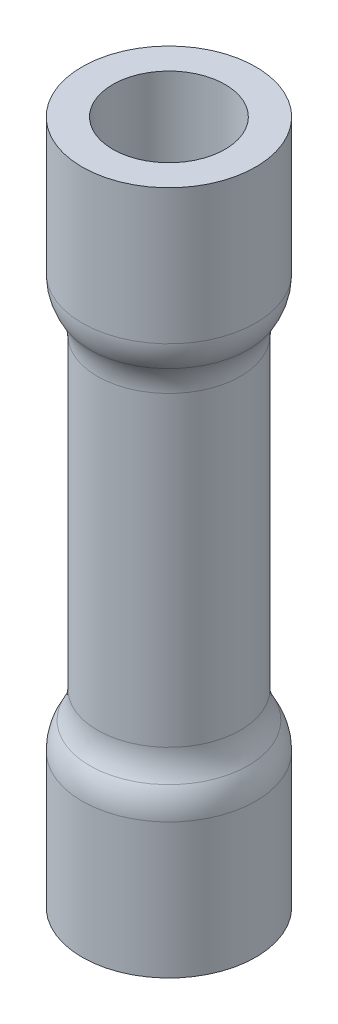
ISO-10303-21;
HEADER;
FILE_DESCRIPTION(('STEP AP214'),'2;1');
FILE_NAME('part.step','',(''),(''),'','','');
FILE_SCHEMA(('AUTOMOTIVE_DESIGN { 1 0 10303 214 1 1 1 1 }'));
ENDSEC;
DATA;
#1=APPLICATION_CONTEXT('core data for automotive mechanical design processes');
#2=APPLICATION_PROTOCOL_DEFINITION('international standard','automotive_design',2000,#1);
#3=PRODUCT_CONTEXT('',#1,'mechanical');
#4=PRODUCT('Part','Part','',(#3));
#5=PRODUCT_RELATED_PRODUCT_CATEGORY('part','',(#4));
#6=PRODUCT_DEFINITION_FORMATION('','',#4);
#7=PRODUCT_DEFINITION_CONTEXT('part definition',#1,'design');
#8=PRODUCT_DEFINITION('design','',#6,#7);
#9=PRODUCT_DEFINITION_SHAPE('','',#8);
#10=(LENGTH_UNIT() NAMED_UNIT(*) SI_UNIT(.MILLI.,.METRE.));
#11=(NAMED_UNIT(*) PLANE_ANGLE_UNIT() SI_UNIT($,.RADIAN.));
#12=(NAMED_UNIT(*) SI_UNIT($,.STERADIAN.) SOLID_ANGLE_UNIT());
#13=UNCERTAINTY_MEASURE_WITH_UNIT(LENGTH_MEASURE(1.E-05),#10,'distance_accuracy_value','');
#14=(GEOMETRIC_REPRESENTATION_CONTEXT(3) GLOBAL_UNCERTAINTY_ASSIGNED_CONTEXT((#13)) GLOBAL_UNIT_ASSIGNED_CONTEXT((#10,
#11,#12)) REPRESENTATION_CONTEXT('',''));
#15=CARTESIAN_POINT('',(0.,0.,0.));
#16=DIRECTION('',(0.,0.,1.));
#17=DIRECTION('',(1.,0.,0.));
#18=AXIS2_PLACEMENT_3D('',#15,#16,#17);
#19=CARTESIAN_POINT('',(0.,17.018,0.));
#20=DIRECTION('',(0.,1.,0.));
#21=DIRECTION('',(0.,0.,1.));
#22=AXIS2_PLACEMENT_3D('',#19,#20,#21);
#23=CYLINDRICAL_SURFACE('',#22,2.159);
#24=CARTESIAN_POINT('',(0.,17.018,0.));
#25=DIRECTION('',(0.,1.,0.));
#26=DIRECTION('',(0.,0.,1.));
#27=AXIS2_PLACEMENT_3D('',#24,#25,#26);
#28=CIRCLE('',#27,2.159);
#29=CARTESIAN_POINT('',(0.,17.018,2.159));
#30=VERTEX_POINT('',#29);
#31=EDGE_CURVE('E10',#30,#30,#28,.T.);
#32=ORIENTED_EDGE('',*,*,#31,.F.);
#33=EDGE_LOOP('',(#32));
#34=FACE_BOUND('',#33,.T.);
#35=CARTESIAN_POINT('',(0.,13.6570280266123,0.));
#36=DIRECTION('',(0.,1.,0.));
#37=DIRECTION('',(0.,0.,1.));
#38=AXIS2_PLACEMENT_3D('',#35,#36,#37);
#39=CIRCLE('',#38,2.159);
#40=CARTESIAN_POINT('',(0.,13.6570280266123,2.159));
#41=VERTEX_POINT('',#40);
#42=EDGE_CURVE('E82',#41,#41,#39,.T.);
#43=ORIENTED_EDGE('',*,*,#42,.T.);
#44=EDGE_LOOP('',(#43));
#45=FACE_BOUND('',#44,.T.);
#46=ADVANCED_FACE('F30',(#34,#45),#23,.T.);
#47=CARTESIAN_POINT('',(1.397,17.018,0.));
#48=DIRECTION('',(0.,1.,0.));
#49=DIRECTION('',(0.,0.,1.));
#50=AXIS2_PLACEMENT_3D('',#47,#48,#49);
#51=PLANE('',#50);
#52=ORIENTED_EDGE('',*,*,#31,.T.);
#53=EDGE_LOOP('',(#52));
#54=FACE_BOUND('',#53,.T.);
#55=CARTESIAN_POINT('',(0.,17.018,0.));
#56=DIRECTION('',(0.,1.,0.));
#57=DIRECTION('',(0.,0.,1.));
#58=AXIS2_PLACEMENT_3D('',#55,#56,#57);
#59=CIRCLE('',#58,1.397);
#60=CARTESIAN_POINT('',(0.,17.018,1.397));
#61=VERTEX_POINT('',#60);
#62=EDGE_CURVE('E36',#61,#61,#59,.T.);
#63=ORIENTED_EDGE('',*,*,#62,.F.);
#64=EDGE_LOOP('',(#63));
#65=FACE_BOUND('',#64,.T.);
#66=ADVANCED_FACE('F135',(#54,#65),#51,.T.);
#67=CARTESIAN_POINT('',(0.,17.018,0.));
#68=DIRECTION('',(0.,1.,0.));
#69=DIRECTION('',(0.,0.,1.));
#70=AXIS2_PLACEMENT_3D('',#67,#68,#69);
#71=CYLINDRICAL_SURFACE('',#70,1.397);
#72=ORIENTED_EDGE('',*,*,#62,.T.);
#73=EDGE_LOOP('',(#72));
#74=FACE_BOUND('',#73,.T.);
#75=CARTESIAN_POINT('',(0.,13.6570280266123,0.));
#76=DIRECTION('',(0.,1.,0.));
#77=DIRECTION('',(0.,0.,1.));
#78=AXIS2_PLACEMENT_3D('',#75,#76,#77);
#79=CIRCLE('',#78,1.397);
#80=CARTESIAN_POINT('',(0.,13.6570280266123,1.397));
#81=VERTEX_POINT('',#80);
#82=EDGE_CURVE('E40',#81,#81,#79,.T.);
#83=ORIENTED_EDGE('',*,*,#82,.F.);
#84=EDGE_LOOP('',(#83));
#85=FACE_BOUND('',#84,.T.);
#86=ADVANCED_FACE('F140',(#74,#85),#71,.F.);
#87=CARTESIAN_POINT('',(0.,13.6570280266123,0.));
#88=DIRECTION('',(0.,1.,0.));
#89=DIRECTION('',(0.,0.,1.));
#90=AXIS2_PLACEMENT_3D('',#87,#88,#89);
#91=TOROIDAL_SURFACE('',#90,0.888999999999999,0.508);
#92=ORIENTED_EDGE('',*,*,#82,.T.);
#93=EDGE_LOOP('',(#92));
#94=FACE_BOUND('',#93,.T.);
#95=CARTESIAN_POINT('',(0.,13.3894224212898,0.));
#96=DIRECTION('',(0.,1.,0.));
#97=DIRECTION('',(0.,0.,1.));
#98=AXIS2_PLACEMENT_3D('',#95,#96,#97);
#99=CIRCLE('',#98,1.3208);
#100=CARTESIAN_POINT('',(0.,13.3894224212898,1.3208));
#101=VERTEX_POINT('',#100);
#102=EDGE_CURVE('E44',#101,#101,#99,.T.);
#103=ORIENTED_EDGE('',*,*,#102,.F.);
#104=EDGE_LOOP('',(#103));
#105=FACE_BOUND('',#104,.T.);
#106=ADVANCED_FACE('F144',(#94,#105),#91,.F.);
#107=CARTESIAN_POINT('',(0.,12.319,0.));
#108=DIRECTION('',(0.,1.,0.));
#109=DIRECTION('',(0.,0.,1.));
#110=AXIS2_PLACEMENT_3D('',#107,#108,#109);
#111=TOROIDAL_SURFACE('',#110,3.048,2.032);
#112=ORIENTED_EDGE('',*,*,#102,.T.);
#113=EDGE_LOOP('',(#112));
#114=FACE_BOUND('',#113,.T.);
#115=CARTESIAN_POINT('',(0.,12.319,0.));
#116=DIRECTION('',(0.,1.,0.));
#117=DIRECTION('',(0.,0.,1.));
#118=AXIS2_PLACEMENT_3D('',#115,#116,#117);
#119=CIRCLE('',#118,1.016);
#120=CARTESIAN_POINT('',(0.,12.319,1.016));
#121=VERTEX_POINT('',#120);
#122=EDGE_CURVE('E49',#121,#121,#119,.T.);
#123=ORIENTED_EDGE('',*,*,#122,.F.);
#124=EDGE_LOOP('',(#123));
#125=FACE_BOUND('',#124,.T.);
#126=ADVANCED_FACE('F150',(#114,#125),#111,.T.);
#127=CARTESIAN_POINT('',(0.,17.018,0.));
#128=DIRECTION('',(0.,1.,0.));
#129=DIRECTION('',(0.,0.,1.));
#130=AXIS2_PLACEMENT_3D('',#127,#128,#129);
#131=CYLINDRICAL_SURFACE('',#130,1.016);
#132=ORIENTED_EDGE('',*,*,#122,.T.);
#133=EDGE_LOOP('',(#132));
#134=FACE_BOUND('',#133,.T.);
#135=CARTESIAN_POINT('',(0.,4.699,0.));
#136=DIRECTION('',(0.,1.,0.));
#137=DIRECTION('',(0.,0.,1.));
#138=AXIS2_PLACEMENT_3D('',#135,#136,#137);
#139=CIRCLE('',#138,1.016);
#140=CARTESIAN_POINT('',(0.,4.699,1.016));
#141=VERTEX_POINT('',#140);
#142=EDGE_CURVE('E52',#141,#141,#139,.T.);
#143=ORIENTED_EDGE('',*,*,#142,.F.);
#144=EDGE_LOOP('',(#143));
#145=FACE_BOUND('',#144,.T.);
#146=ADVANCED_FACE('F154',(#134,#145),#131,.F.);
#147=CARTESIAN_POINT('',(0.,4.699,0.));
#148=DIRECTION('',(0.,1.,0.));
#149=DIRECTION('',(0.,0.,1.));
#150=AXIS2_PLACEMENT_3D('',#147,#148,#149);
#151=TOROIDAL_SURFACE('',#150,3.048,2.032);
#152=ORIENTED_EDGE('',*,*,#142,.T.);
#153=EDGE_LOOP('',(#152));
#154=FACE_BOUND('',#153,.T.);
#155=CARTESIAN_POINT('',(0.,3.62857757871017,0.));
#156=DIRECTION('',(0.,1.,0.));
#157=DIRECTION('',(0.,0.,1.));
#158=AXIS2_PLACEMENT_3D('',#155,#156,#157);
#159=CIRCLE('',#158,1.3208);
#160=CARTESIAN_POINT('',(0.,3.62857757871017,1.3208));
#161=VERTEX_POINT('',#160);
#162=EDGE_CURVE('E55',#161,#161,#159,.T.);
#163=ORIENTED_EDGE('',*,*,#162,.F.);
#164=EDGE_LOOP('',(#163));
#165=FACE_BOUND('',#164,.T.);
#166=ADVANCED_FACE('F158',(#154,#165),#151,.T.);
#167=CARTESIAN_POINT('',(0.,3.36097197338771,0.));
#168=DIRECTION('',(0.,1.,0.));
#169=DIRECTION('',(0.,0.,1.));
#170=AXIS2_PLACEMENT_3D('',#167,#168,#169);
#171=TOROIDAL_SURFACE('',#170,0.888999999999999,0.508000000000001);
#172=ORIENTED_EDGE('',*,*,#162,.T.);
#173=EDGE_LOOP('',(#172));
#174=FACE_BOUND('',#173,.T.);
#175=CARTESIAN_POINT('',(0.,3.36097197338771,0.));
#176=DIRECTION('',(0.,1.,0.));
#177=DIRECTION('',(0.,0.,1.));
#178=AXIS2_PLACEMENT_3D('',#175,#176,#177);
#179=CIRCLE('',#178,1.397);
#180=CARTESIAN_POINT('',(0.,3.36097197338771,1.397));
#181=VERTEX_POINT('',#180);
#182=EDGE_CURVE('E58',#181,#181,#179,.T.);
#183=ORIENTED_EDGE('',*,*,#182,.F.);
#184=EDGE_LOOP('',(#183));
#185=FACE_BOUND('',#184,.T.);
#186=ADVANCED_FACE('F131',(#174,#185),#171,.F.);
#187=CARTESIAN_POINT('',(0.,17.018,0.));
#188=DIRECTION('',(0.,1.,0.));
#189=DIRECTION('',(0.,0.,1.));
#190=AXIS2_PLACEMENT_3D('',#187,#188,#189);
#191=CYLINDRICAL_SURFACE('',#190,1.397);
#192=ORIENTED_EDGE('',*,*,#182,.T.);
#193=EDGE_LOOP('',(#192));
#194=FACE_BOUND('',#193,.T.);
#195=CARTESIAN_POINT('',(0.,0.,0.));
#196=DIRECTION('',(0.,1.,0.));
#197=DIRECTION('',(0.,0.,1.));
#198=AXIS2_PLACEMENT_3D('',#195,#196,#197);
#199=CIRCLE('',#198,1.397);
#200=CARTESIAN_POINT('',(0.,0.,1.397));
#201=VERTEX_POINT('',#200);
#202=EDGE_CURVE('E61',#201,#201,#199,.T.);
#203=ORIENTED_EDGE('',*,*,#202,.F.);
#204=EDGE_LOOP('',(#203));
#205=FACE_BOUND('',#204,.T.);
#206=ADVANCED_FACE('F125',(#194,#205),#191,.F.);
#207=CARTESIAN_POINT('',(2.159,0.,0.));
#208=DIRECTION('',(0.,-1.,0.));
#209=DIRECTION('',(0.,0.,-1.));
#210=AXIS2_PLACEMENT_3D('',#207,#208,#209);
#211=PLANE('',#210);
#212=ORIENTED_EDGE('',*,*,#202,.T.);
#213=EDGE_LOOP('',(#212));
#214=FACE_BOUND('',#213,.T.);
#215=CARTESIAN_POINT('',(0.,0.,0.));
#216=DIRECTION('',(0.,1.,0.));
#217=DIRECTION('',(0.,0.,1.));
#218=AXIS2_PLACEMENT_3D('',#215,#216,#217);
#219=CIRCLE('',#218,2.159);
#220=CARTESIAN_POINT('',(0.,0.,2.159));
#221=VERTEX_POINT('',#220);
#222=EDGE_CURVE('E64',#221,#221,#219,.T.);
#223=ORIENTED_EDGE('',*,*,#222,.F.);
#224=EDGE_LOOP('',(#223));
#225=FACE_BOUND('',#224,.T.);
#226=ADVANCED_FACE('F120',(#214,#225),#211,.T.);
#227=CARTESIAN_POINT('',(0.,17.018,0.));
#228=DIRECTION('',(0.,1.,0.));
#229=DIRECTION('',(0.,0.,1.));
#230=AXIS2_PLACEMENT_3D('',#227,#228,#229);
#231=CYLINDRICAL_SURFACE('',#230,2.159);
#232=CARTESIAN_POINT('',(0.,3.36097197338771,0.));
#233=DIRECTION('',(0.,1.,0.));
#234=DIRECTION('',(0.,0.,1.));
#235=AXIS2_PLACEMENT_3D('',#232,#233,#234);
#236=CIRCLE('',#235,2.159);
#237=CARTESIAN_POINT('',(0.,3.36097197338771,2.159));
#238=VERTEX_POINT('',#237);
#239=EDGE_CURVE('E67',#238,#238,#236,.T.);
#240=ORIENTED_EDGE('',*,*,#239,.F.);
#241=EDGE_LOOP('',(#240));
#242=FACE_BOUND('',#241,.T.);
#243=ORIENTED_EDGE('',*,*,#222,.T.);
#244=EDGE_LOOP('',(#243));
#245=FACE_BOUND('',#244,.T.);
#246=ADVANCED_FACE('F114',(#242,#245),#231,.T.);
#247=CARTESIAN_POINT('',(0.,3.36097197338771,0.));
#248=DIRECTION('',(0.,1.,0.));
#249=DIRECTION('',(0.,0.,1.));
#250=AXIS2_PLACEMENT_3D('',#247,#248,#249);
#251=DEGENERATE_TOROIDAL_SURFACE('',#250,0.888999999999999,1.27,.T.);
#252=CARTESIAN_POINT('',(0.,4.02998598669385,0.));
#253=DIRECTION('',(0.,1.,0.));
#254=DIRECTION('',(0.,0.,1.));
#255=AXIS2_PLACEMENT_3D('',#252,#253,#254);
#256=CIRCLE('',#255,1.9685);
#257=CARTESIAN_POINT('',(0.,4.02998598669385,1.9685));
#258=VERTEX_POINT('',#257);
#259=EDGE_CURVE('E70',#258,#258,#256,.T.);
#260=ORIENTED_EDGE('',*,*,#259,.F.);
#261=EDGE_LOOP('',(#260));
#262=FACE_BOUND('',#261,.T.);
#263=ORIENTED_EDGE('',*,*,#239,.T.);
#264=EDGE_LOOP('',(#263));
#265=FACE_BOUND('',#264,.T.);
#266=ADVANCED_FACE('F108',(#262,#265),#251,.T.);
#267=CARTESIAN_POINT('',(0.,4.699,0.));
#268=DIRECTION('',(0.,1.,0.));
#269=DIRECTION('',(0.,0.,1.));
#270=AXIS2_PLACEMENT_3D('',#267,#268,#269);
#271=TOROIDAL_SURFACE('',#270,3.048,1.27);
#272=CARTESIAN_POINT('',(0.,4.699,0.));
#273=DIRECTION('',(0.,1.,0.));
#274=DIRECTION('',(0.,0.,1.));
#275=AXIS2_PLACEMENT_3D('',#272,#273,#274);
#276=CIRCLE('',#275,1.778);
#277=CARTESIAN_POINT('',(0.,4.699,1.778));
#278=VERTEX_POINT('',#277);
#279=EDGE_CURVE('E73',#278,#278,#276,.T.);
#280=ORIENTED_EDGE('',*,*,#279,.F.);
#281=EDGE_LOOP('',(#280));
#282=FACE_BOUND('',#281,.T.);
#283=ORIENTED_EDGE('',*,*,#259,.T.);
#284=EDGE_LOOP('',(#283));
#285=FACE_BOUND('',#284,.T.);
#286=ADVANCED_FACE('F102',(#282,#285),#271,.F.);
#287=CARTESIAN_POINT('',(0.,17.018,0.));
#288=DIRECTION('',(0.,1.,0.));
#289=DIRECTION('',(0.,0.,1.));
#290=AXIS2_PLACEMENT_3D('',#287,#288,#289);
#291=CYLINDRICAL_SURFACE('',#290,1.778);
#292=CARTESIAN_POINT('',(0.,12.319,0.));
#293=DIRECTION('',(0.,1.,0.));
#294=DIRECTION('',(0.,0.,1.));
#295=AXIS2_PLACEMENT_3D('',#292,#293,#294);
#296=CIRCLE('',#295,1.778);
#297=CARTESIAN_POINT('',(0.,12.319,1.778));
#298=VERTEX_POINT('',#297);
#299=EDGE_CURVE('E76',#298,#298,#296,.T.);
#300=ORIENTED_EDGE('',*,*,#299,.F.);
#301=EDGE_LOOP('',(#300));
#302=FACE_BOUND('',#301,.T.);
#303=ORIENTED_EDGE('',*,*,#279,.T.);
#304=EDGE_LOOP('',(#303));
#305=FACE_BOUND('',#304,.T.);
#306=ADVANCED_FACE('F96',(#302,#305),#291,.T.);
#307=CARTESIAN_POINT('',(0.,12.319,0.));
#308=DIRECTION('',(0.,1.,0.));
#309=DIRECTION('',(0.,0.,1.));
#310=AXIS2_PLACEMENT_3D('',#307,#308,#309);
#311=TOROIDAL_SURFACE('',#310,3.048,1.27);
#312=CARTESIAN_POINT('',(0.,12.9880140133061,0.));
#313=DIRECTION('',(0.,1.,0.));
#314=DIRECTION('',(0.,0.,1.));
#315=AXIS2_PLACEMENT_3D('',#312,#313,#314);
#316=CIRCLE('',#315,1.9685);
#317=CARTESIAN_POINT('',(0.,12.9880140133061,1.9685));
#318=VERTEX_POINT('',#317);
#319=EDGE_CURVE('E79',#318,#318,#316,.T.);
#320=ORIENTED_EDGE('',*,*,#319,.F.);
#321=EDGE_LOOP('',(#320));
#322=FACE_BOUND('',#321,.T.);
#323=ORIENTED_EDGE('',*,*,#299,.T.);
#324=EDGE_LOOP('',(#323));
#325=FACE_BOUND('',#324,.T.);
#326=ADVANCED_FACE('F90',(#322,#325),#311,.F.);
#327=CARTESIAN_POINT('',(0.,13.6570280266123,0.));
#328=DIRECTION('',(0.,1.,0.));
#329=DIRECTION('',(0.,0.,1.));
#330=AXIS2_PLACEMENT_3D('',#327,#328,#329);
#331=DEGENERATE_TOROIDAL_SURFACE('',#330,0.888999999999999,1.27,.T.);
#332=ORIENTED_EDGE('',*,*,#42,.F.);
#333=EDGE_LOOP('',(#332));
#334=FACE_BOUND('',#333,.T.);
#335=ORIENTED_EDGE('',*,*,#319,.T.);
#336=EDGE_LOOP('',(#335));
#337=FACE_BOUND('',#336,.T.);
#338=ADVANCED_FACE('F87',(#334,#337),#331,.T.);
#339=CLOSED_SHELL('',(#46,#66,#86,#106,#126,#146,#166,#186,#206,#226,#246,#266,#286,#306,#326,#338));
#340=MANIFOLD_SOLID_BREP('B2',#339);
#341=ADVANCED_BREP_SHAPE_REPRESENTATION('',(#18,#340),#14);
#342=SHAPE_DEFINITION_REPRESENTATION(#9,#341);
ENDSEC;
END-ISO-10303-21;
